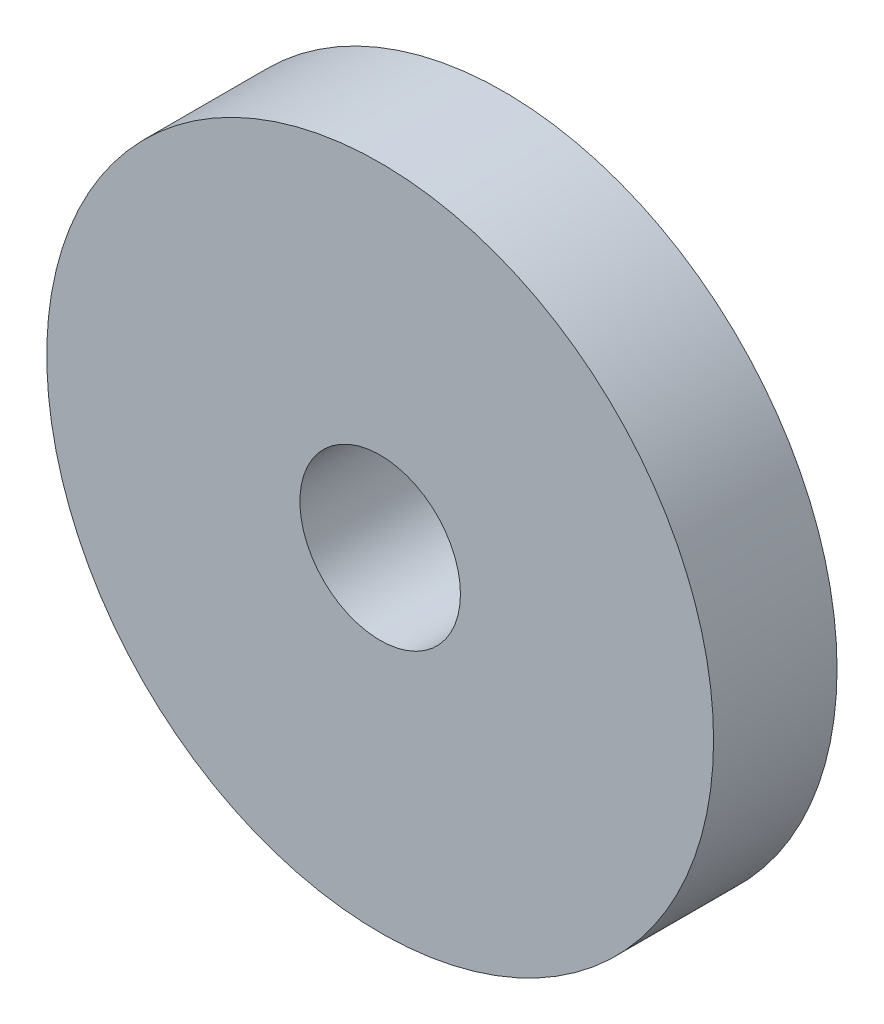
ISO-10303-21;
HEADER;
FILE_DESCRIPTION(('STEP AP214'),'2;1');
FILE_NAME('part.step','',(''),(''),'','','');
FILE_SCHEMA(('AUTOMOTIVE_DESIGN { 1 0 10303 214 1 1 1 1 }'));
ENDSEC;
DATA;
#1=APPLICATION_CONTEXT('core data for automotive mechanical design processes');
#2=APPLICATION_PROTOCOL_DEFINITION('international standard','automotive_design',2000,#1);
#3=PRODUCT_CONTEXT('',#1,'mechanical');
#4=PRODUCT('Part','Part','',(#3));
#5=PRODUCT_RELATED_PRODUCT_CATEGORY('part','',(#4));
#6=PRODUCT_DEFINITION_FORMATION('','',#4);
#7=PRODUCT_DEFINITION_CONTEXT('part definition',#1,'design');
#8=PRODUCT_DEFINITION('design','',#6,#7);
#9=PRODUCT_DEFINITION_SHAPE('','',#8);
#10=(LENGTH_UNIT() NAMED_UNIT(*) SI_UNIT(.MILLI.,.METRE.));
#11=(NAMED_UNIT(*) PLANE_ANGLE_UNIT() SI_UNIT($,.RADIAN.));
#12=(NAMED_UNIT(*) SI_UNIT($,.STERADIAN.) SOLID_ANGLE_UNIT());
#13=UNCERTAINTY_MEASURE_WITH_UNIT(LENGTH_MEASURE(1.E-05),#10,'distance_accuracy_value','');
#14=(GEOMETRIC_REPRESENTATION_CONTEXT(3) GLOBAL_UNCERTAINTY_ASSIGNED_CONTEXT((#13)) GLOBAL_UNIT_ASSIGNED_CONTEXT((#10,
#11,#12)) REPRESENTATION_CONTEXT('',''));
#15=CARTESIAN_POINT('',(0.,0.,0.));
#16=DIRECTION('',(0.,0.,1.));
#17=DIRECTION('',(1.,0.,0.));
#18=AXIS2_PLACEMENT_3D('',#15,#16,#17);
#19=CARTESIAN_POINT('',(0.,0.,20.));
#20=DIRECTION('',(0.,0.,-1.));
#21=DIRECTION('',(-1.,0.,0.));
#22=AXIS2_PLACEMENT_3D('',#19,#20,#21);
#23=CYLINDRICAL_SURFACE('',#22,54.);
#24=CARTESIAN_POINT('',(0.,0.,20.));
#25=DIRECTION('',(0.,0.,1.));
#26=DIRECTION('',(1.,0.,0.));
#27=AXIS2_PLACEMENT_3D('',#24,#25,#26);
#28=CIRCLE('',#27,54.);
#29=CARTESIAN_POINT('',(54.,0.,20.));
#30=VERTEX_POINT('',#29);
#31=EDGE_CURVE('E10',#30,#30,#28,.T.);
#32=ORIENTED_EDGE('',*,*,#31,.F.);
#33=EDGE_LOOP('',(#32));
#34=FACE_BOUND('',#33,.T.);
#35=CARTESIAN_POINT('',(0.,0.,0.));
#36=DIRECTION('',(0.,0.,1.));
#37=DIRECTION('',(1.,0.,0.));
#38=AXIS2_PLACEMENT_3D('',#35,#36,#37);
#39=CIRCLE('',#38,54.);
#40=CARTESIAN_POINT('',(54.,0.,0.));
#41=VERTEX_POINT('',#40);
#42=EDGE_CURVE('E33',#41,#41,#39,.T.);
#43=ORIENTED_EDGE('',*,*,#42,.T.);
#44=EDGE_LOOP('',(#43));
#45=FACE_BOUND('',#44,.T.);
#46=ADVANCED_FACE('F30',(#34,#45),#23,.T.);
#47=CARTESIAN_POINT('',(0.,0.,20.));
#48=DIRECTION('',(0.,0.,1.));
#49=DIRECTION('',(1.,0.,0.));
#50=AXIS2_PLACEMENT_3D('',#47,#48,#49);
#51=PLANE('',#50);
#52=CARTESIAN_POINT('',(0.,0.,20.));
#53=DIRECTION('',(0.,0.,1.));
#54=DIRECTION('',(1.,0.,0.));
#55=AXIS2_PLACEMENT_3D('',#52,#53,#54);
#56=CIRCLE('',#55,13.);
#57=CARTESIAN_POINT('',(13.,0.,20.));
#58=VERTEX_POINT('',#57);
#59=EDGE_CURVE('E44',#58,#58,#56,.T.);
#60=ORIENTED_EDGE('',*,*,#59,.F.);
#61=EDGE_LOOP('',(#60));
#62=FACE_BOUND('',#61,.T.);
#63=ORIENTED_EDGE('',*,*,#31,.T.);
#64=EDGE_LOOP('',(#63));
#65=FACE_BOUND('',#64,.T.);
#66=ADVANCED_FACE('F51',(#62,#65),#51,.T.);
#67=CARTESIAN_POINT('',(0.,0.,0.));
#68=DIRECTION('',(0.,0.,1.));
#69=DIRECTION('',(1.,0.,0.));
#70=AXIS2_PLACEMENT_3D('',#67,#68,#69);
#71=PLANE('',#70);
#72=CARTESIAN_POINT('',(0.,0.,0.));
#73=DIRECTION('',(0.,0.,1.));
#74=DIRECTION('',(1.,0.,0.));
#75=AXIS2_PLACEMENT_3D('',#72,#73,#74);
#76=CIRCLE('',#75,13.);
#77=CARTESIAN_POINT('',(13.,0.,0.));
#78=VERTEX_POINT('',#77);
#79=EDGE_CURVE('E40',#78,#78,#76,.F.);
#80=ORIENTED_EDGE('',*,*,#79,.F.);
#81=EDGE_LOOP('',(#80));
#82=FACE_BOUND('',#81,.T.);
#83=ORIENTED_EDGE('',*,*,#42,.F.);
#84=EDGE_LOOP('',(#83));
#85=FACE_BOUND('',#84,.T.);
#86=ADVANCED_FACE('F53',(#82,#85),#71,.F.);
#87=CARTESIAN_POINT('',(0.,0.,-0.001000000000001));
#88=DIRECTION('',(0.,0.,1.));
#89=DIRECTION('',(1.,0.,0.));
#90=AXIS2_PLACEMENT_3D('',#87,#88,#89);
#91=CYLINDRICAL_SURFACE('',#90,13.);
#92=ORIENTED_EDGE('',*,*,#59,.T.);
#93=EDGE_LOOP('',(#92));
#94=FACE_BOUND('',#93,.T.);
#95=ORIENTED_EDGE('',*,*,#79,.T.);
#96=EDGE_LOOP('',(#95));
#97=FACE_BOUND('',#96,.T.);
#98=ADVANCED_FACE('F48',(#94,#97),#91,.F.);
#99=CLOSED_SHELL('',(#46,#66,#86,#98));
#100=MANIFOLD_SOLID_BREP('B2',#99);
#101=ADVANCED_BREP_SHAPE_REPRESENTATION('',(#18,#100),#14);
#102=SHAPE_DEFINITION_REPRESENTATION(#9,#101);
ENDSEC;
END-ISO-10303-21;
